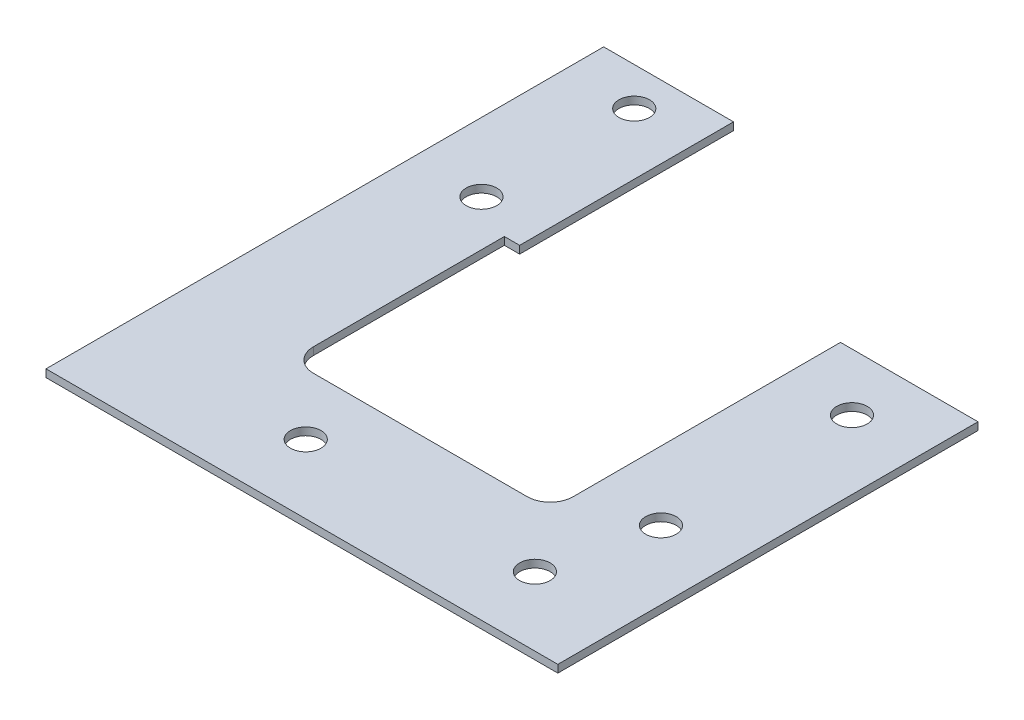
ISO-10303-21;
HEADER;
FILE_DESCRIPTION(('STEP AP214'),'2;1');
FILE_NAME('part.step','',(''),(''),'','','');
FILE_SCHEMA(('AUTOMOTIVE_DESIGN { 1 0 10303 214 1 1 1 1 }'));
ENDSEC;
DATA;
#1=APPLICATION_CONTEXT('core data for automotive mechanical design processes');
#2=APPLICATION_PROTOCOL_DEFINITION('international standard','automotive_design',2000,#1);
#3=PRODUCT_CONTEXT('',#1,'mechanical');
#4=PRODUCT('Part','Part','',(#3));
#5=PRODUCT_RELATED_PRODUCT_CATEGORY('part','',(#4));
#6=PRODUCT_DEFINITION_FORMATION('','',#4);
#7=PRODUCT_DEFINITION_CONTEXT('part definition',#1,'design');
#8=PRODUCT_DEFINITION('design','',#6,#7);
#9=PRODUCT_DEFINITION_SHAPE('','',#8);
#10=(LENGTH_UNIT() NAMED_UNIT(*) SI_UNIT(.MILLI.,.METRE.));
#11=(NAMED_UNIT(*) PLANE_ANGLE_UNIT() SI_UNIT($,.RADIAN.));
#12=(NAMED_UNIT(*) SI_UNIT($,.STERADIAN.) SOLID_ANGLE_UNIT());
#13=UNCERTAINTY_MEASURE_WITH_UNIT(LENGTH_MEASURE(1.E-05),#10,'distance_accuracy_value','');
#14=(GEOMETRIC_REPRESENTATION_CONTEXT(3) GLOBAL_UNCERTAINTY_ASSIGNED_CONTEXT((#13)) GLOBAL_UNIT_ASSIGNED_CONTEXT((#10,
#11,#12)) REPRESENTATION_CONTEXT('',''));
#15=CARTESIAN_POINT('',(0.,0.,0.));
#16=DIRECTION('',(0.,0.,1.));
#17=DIRECTION('',(1.,0.,0.));
#18=AXIS2_PLACEMENT_3D('',#15,#16,#17);
#19=CARTESIAN_POINT('',(-6.,1.,-5.));
#20=DIRECTION('',(0.,-1.,0.));
#21=DIRECTION('',(0.,0.,-1.));
#22=AXIS2_PLACEMENT_3D('',#19,#20,#21);
#23=PLANE('',#22);
#24=DIRECTION('',(0.,0.,-1.));
#25=VECTOR('',#24,1.);
#26=CARTESIAN_POINT('',(15.,1.,0.));
#27=LINE('',#26,#25);
#28=CARTESIAN_POINT('',(15.,1.,15.));
#29=VERTEX_POINT('',#28);
#30=CARTESIAN_POINT('',(15.,1.,-40.));
#31=VERTEX_POINT('',#30);
#32=EDGE_CURVE('E50',#29,#31,#27,.T.);
#33=ORIENTED_EDGE('',*,*,#32,.T.);
#34=DIRECTION('',(-1.,0.,0.));
#35=VECTOR('',#34,1.);
#36=CARTESIAN_POINT('',(0.,1.,-40.));
#37=LINE('',#36,#35);
#38=CARTESIAN_POINT('',(-3.,1.,-40.));
#39=VERTEX_POINT('',#38);
#40=EDGE_CURVE('E106',#31,#39,#37,.T.);
#41=ORIENTED_EDGE('',*,*,#40,.T.);
#42=DIRECTION('',(0.,0.,1.));
#43=VECTOR('',#42,1.);
#44=CARTESIAN_POINT('',(-3.,1.,-40.));
#45=LINE('',#44,#43);
#46=CARTESIAN_POINT('',(-3.,1.,-5.00000000000002));
#47=VERTEX_POINT('',#46);
#48=EDGE_CURVE('E207',#39,#47,#45,.T.);
#49=ORIENTED_EDGE('',*,*,#48,.T.);
#50=CARTESIAN_POINT('',(-6.,1.,-5.));
#51=DIRECTION('',(0.,-1.,0.));
#52=DIRECTION('',(0.,0.,-1.));
#53=AXIS2_PLACEMENT_3D('',#50,#51,#52);
#54=CIRCLE('',#53,3.);
#55=CARTESIAN_POINT('',(-6.00000000000002,1.,-2.));
#56=VERTEX_POINT('',#55);
#57=EDGE_CURVE('E226',#47,#56,#54,.T.);
#58=ORIENTED_EDGE('',*,*,#57,.T.);
#59=DIRECTION('',(-1.,0.,0.));
#60=VECTOR('',#59,1.);
#61=CARTESIAN_POINT('',(-6.00000000000002,1.,-2.));
#62=LINE('',#61,#60);
#63=CARTESIAN_POINT('',(-34.,1.,-2.));
#64=VERTEX_POINT('',#63);
#65=EDGE_CURVE('E223',#56,#64,#62,.T.);
#66=ORIENTED_EDGE('',*,*,#65,.T.);
#67=CARTESIAN_POINT('',(-34.,1.,-5.));
#68=DIRECTION('',(0.,-1.,0.));
#69=DIRECTION('',(0.,0.,-1.));
#70=AXIS2_PLACEMENT_3D('',#67,#68,#69);
#71=CIRCLE('',#70,3.);
#72=CARTESIAN_POINT('',(-37.,1.,-5.00000000000002));
#73=VERTEX_POINT('',#72);
#74=EDGE_CURVE('E225',#64,#73,#71,.T.);
#75=ORIENTED_EDGE('',*,*,#74,.T.);
#76=DIRECTION('',(0.,0.,-1.));
#77=VECTOR('',#76,1.);
#78=CARTESIAN_POINT('',(-37.,1.,-30.));
#79=LINE('',#78,#77);
#80=CARTESIAN_POINT('',(-37.,1.,-30.));
#81=VERTEX_POINT('',#80);
#82=EDGE_CURVE('E228',#73,#81,#79,.T.);
#83=ORIENTED_EDGE('',*,*,#82,.T.);
#84=DIRECTION('',(1.,0.,0.));
#85=VECTOR('',#84,1.);
#86=CARTESIAN_POINT('',(-35.,1.,-30.));
#87=LINE('',#86,#85);
#88=CARTESIAN_POINT('',(-35.,1.,-30.));
#89=VERTEX_POINT('',#88);
#90=EDGE_CURVE('E234',#81,#89,#87,.T.);
#91=ORIENTED_EDGE('',*,*,#90,.T.);
#92=DIRECTION('',(0.,0.,-1.));
#93=VECTOR('',#92,1.);
#94=CARTESIAN_POINT('',(-35.,1.,-58.));
#95=LINE('',#94,#93);
#96=CARTESIAN_POINT('',(-35.,1.,-58.));
#97=VERTEX_POINT('',#96);
#98=EDGE_CURVE('E138',#89,#97,#95,.T.);
#99=ORIENTED_EDGE('',*,*,#98,.T.);
#100=DIRECTION('',(-1.,0.,0.));
#101=VECTOR('',#100,1.);
#102=CARTESIAN_POINT('',(-37.,1.,-58.));
#103=LINE('',#102,#101);
#104=CARTESIAN_POINT('',(-52.,1.,-58.));
#105=VERTEX_POINT('',#104);
#106=EDGE_CURVE('E132',#97,#105,#103,.T.);
#107=ORIENTED_EDGE('',*,*,#106,.T.);
#108=DIRECTION('',(0.,0.,1.));
#109=VECTOR('',#108,1.);
#110=CARTESIAN_POINT('',(-52.,1.,15.));
#111=LINE('',#110,#109);
#112=CARTESIAN_POINT('',(-52.,1.,15.));
#113=VERTEX_POINT('',#112);
#114=EDGE_CURVE('E136',#105,#113,#111,.T.);
#115=ORIENTED_EDGE('',*,*,#114,.T.);
#116=DIRECTION('',(1.,0.,0.));
#117=VECTOR('',#116,1.);
#118=CARTESIAN_POINT('',(15.,1.,15.));
#119=LINE('',#118,#117);
#120=EDGE_CURVE('E151',#113,#29,#119,.T.);
#121=ORIENTED_EDGE('',*,*,#120,.T.);
#122=EDGE_LOOP('',(#33,#41,#49,#58,#66,#75,#83,#91,#99,#107,#115,#121));
#123=FACE_BOUND('',#122,.T.);
#124=CARTESIAN_POINT('',(6.,1.,-32.5));
#125=DIRECTION('',(0.,1.,0.));
#126=DIRECTION('',(0.,0.,1.));
#127=AXIS2_PLACEMENT_3D('',#124,#125,#126);
#128=CIRCLE('',#127,2.);
#129=CARTESIAN_POINT('',(6.,1.,-30.5));
#130=VERTEX_POINT('',#129);
#131=EDGE_CURVE('E160',#130,#130,#128,.T.);
#132=ORIENTED_EDGE('',*,*,#131,.F.);
#133=EDGE_LOOP('',(#132));
#134=FACE_BOUND('',#133,.T.);
#135=CARTESIAN_POINT('',(6.,1.,-7.5));
#136=DIRECTION('',(0.,1.,0.));
#137=DIRECTION('',(0.,0.,1.));
#138=AXIS2_PLACEMENT_3D('',#135,#136,#137);
#139=CIRCLE('',#138,2.);
#140=CARTESIAN_POINT('',(6.,1.,-5.5));
#141=VERTEX_POINT('',#140);
#142=EDGE_CURVE('E462',#141,#141,#139,.T.);
#143=ORIENTED_EDGE('',*,*,#142,.F.);
#144=EDGE_LOOP('',(#143));
#145=FACE_BOUND('',#144,.T.);
#146=CARTESIAN_POINT('',(-43.,1.,-53.));
#147=DIRECTION('',(0.,1.,0.));
#148=DIRECTION('',(0.,0.,1.));
#149=AXIS2_PLACEMENT_3D('',#146,#147,#148);
#150=CIRCLE('',#149,2.);
#151=CARTESIAN_POINT('',(-43.,1.,-51.));
#152=VERTEX_POINT('',#151);
#153=EDGE_CURVE('E456',#152,#152,#150,.T.);
#154=ORIENTED_EDGE('',*,*,#153,.F.);
#155=EDGE_LOOP('',(#154));
#156=FACE_BOUND('',#155,.T.);
#157=CARTESIAN_POINT('',(-43.,1.,-33.));
#158=DIRECTION('',(0.,1.,0.));
#159=DIRECTION('',(0.,0.,1.));
#160=AXIS2_PLACEMENT_3D('',#157,#158,#159);
#161=CIRCLE('',#160,2.);
#162=CARTESIAN_POINT('',(-43.,1.,-31.));
#163=VERTEX_POINT('',#162);
#164=EDGE_CURVE('E450',#163,#163,#161,.T.);
#165=ORIENTED_EDGE('',*,*,#164,.F.);
#166=EDGE_LOOP('',(#165));
#167=FACE_BOUND('',#166,.T.);
#168=CARTESIAN_POINT('',(-27.,1.,6.00000000000001));
#169=DIRECTION('',(0.,1.,0.));
#170=DIRECTION('',(0.,0.,1.));
#171=AXIS2_PLACEMENT_3D('',#168,#169,#170);
#172=CIRCLE('',#171,2.);
#173=CARTESIAN_POINT('',(-27.,1.,8.00000000000001));
#174=VERTEX_POINT('',#173);
#175=EDGE_CURVE('E444',#174,#174,#172,.T.);
#176=ORIENTED_EDGE('',*,*,#175,.F.);
#177=EDGE_LOOP('',(#176));
#178=FACE_BOUND('',#177,.T.);
#179=CARTESIAN_POINT('',(3.00000000000001,1.,5.99999999999999));
#180=DIRECTION('',(0.,1.,0.));
#181=DIRECTION('',(0.,0.,1.));
#182=AXIS2_PLACEMENT_3D('',#179,#180,#181);
#183=CIRCLE('',#182,2.);
#184=CARTESIAN_POINT('',(3.00000000000001,1.,7.99999999999999));
#185=VERTEX_POINT('',#184);
#186=EDGE_CURVE('E435',#185,#185,#183,.T.);
#187=ORIENTED_EDGE('',*,*,#186,.F.);
#188=EDGE_LOOP('',(#187));
#189=FACE_BOUND('',#188,.T.);
#190=ADVANCED_FACE('F33',(#123,#134,#145,#156,#167,#178,#189),#23,.F.);
#191=CARTESIAN_POINT('',(-6.,0.,-5.));
#192=DIRECTION('',(0.,-1.,0.));
#193=DIRECTION('',(0.,0.,-1.));
#194=AXIS2_PLACEMENT_3D('',#191,#192,#193);
#195=PLANE('',#194);
#196=CARTESIAN_POINT('',(-27.,0.,6.00000000000001));
#197=DIRECTION('',(0.,1.,0.));
#198=DIRECTION('',(0.,0.,1.));
#199=AXIS2_PLACEMENT_3D('',#196,#197,#198);
#200=CIRCLE('',#199,2.);
#201=CARTESIAN_POINT('',(-27.,0.,8.00000000000001));
#202=VERTEX_POINT('',#201);
#203=EDGE_CURVE('E441',#202,#202,#200,.T.);
#204=ORIENTED_EDGE('',*,*,#203,.T.);
#205=EDGE_LOOP('',(#204));
#206=FACE_BOUND('',#205,.T.);
#207=CARTESIAN_POINT('',(-43.,0.,-53.));
#208=DIRECTION('',(0.,1.,0.));
#209=DIRECTION('',(0.,0.,1.));
#210=AXIS2_PLACEMENT_3D('',#207,#208,#209);
#211=CIRCLE('',#210,2.);
#212=CARTESIAN_POINT('',(-43.,0.,-51.));
#213=VERTEX_POINT('',#212);
#214=EDGE_CURVE('E453',#213,#213,#211,.T.);
#215=ORIENTED_EDGE('',*,*,#214,.T.);
#216=EDGE_LOOP('',(#215));
#217=FACE_BOUND('',#216,.T.);
#218=CARTESIAN_POINT('',(6.,0.,-32.5));
#219=DIRECTION('',(0.,1.,0.));
#220=DIRECTION('',(0.,0.,1.));
#221=AXIS2_PLACEMENT_3D('',#218,#219,#220);
#222=CIRCLE('',#221,2.);
#223=CARTESIAN_POINT('',(6.,0.,-30.5));
#224=VERTEX_POINT('',#223);
#225=EDGE_CURVE('E465',#224,#224,#222,.T.);
#226=ORIENTED_EDGE('',*,*,#225,.T.);
#227=EDGE_LOOP('',(#226));
#228=FACE_BOUND('',#227,.T.);
#229=DIRECTION('',(-1.,0.,0.));
#230=VECTOR('',#229,1.);
#231=CARTESIAN_POINT('',(0.,0.,-40.));
#232=LINE('',#231,#230);
#233=CARTESIAN_POINT('',(15.,0.,-40.));
#234=VERTEX_POINT('',#233);
#235=CARTESIAN_POINT('',(-3.,0.,-40.));
#236=VERTEX_POINT('',#235);
#237=EDGE_CURVE('E157',#234,#236,#232,.T.);
#238=ORIENTED_EDGE('',*,*,#237,.F.);
#239=DIRECTION('',(0.,0.,-1.));
#240=VECTOR('',#239,1.);
#241=CARTESIAN_POINT('',(15.,0.,0.));
#242=LINE('',#241,#240);
#243=CARTESIAN_POINT('',(15.,0.,15.));
#244=VERTEX_POINT('',#243);
#245=EDGE_CURVE('E178',#244,#234,#242,.T.);
#246=ORIENTED_EDGE('',*,*,#245,.F.);
#247=DIRECTION('',(1.,0.,0.));
#248=VECTOR('',#247,1.);
#249=CARTESIAN_POINT('',(15.,0.,15.));
#250=LINE('',#249,#248);
#251=CARTESIAN_POINT('',(-52.,0.,15.));
#252=VERTEX_POINT('',#251);
#253=EDGE_CURVE('E99',#252,#244,#250,.T.);
#254=ORIENTED_EDGE('',*,*,#253,.F.);
#255=DIRECTION('',(0.,0.,1.));
#256=VECTOR('',#255,1.);
#257=CARTESIAN_POINT('',(-52.,0.,15.));
#258=LINE('',#257,#256);
#259=CARTESIAN_POINT('',(-52.,0.,-58.));
#260=VERTEX_POINT('',#259);
#261=EDGE_CURVE('E92',#260,#252,#258,.T.);
#262=ORIENTED_EDGE('',*,*,#261,.F.);
#263=DIRECTION('',(-1.,0.,0.));
#264=VECTOR('',#263,1.);
#265=CARTESIAN_POINT('',(-52.,0.,-58.));
#266=LINE('',#265,#264);
#267=CARTESIAN_POINT('',(-35.,0.,-58.));
#268=VERTEX_POINT('',#267);
#269=EDGE_CURVE('E145',#268,#260,#266,.T.);
#270=ORIENTED_EDGE('',*,*,#269,.F.);
#271=DIRECTION('',(0.,0.,-1.));
#272=VECTOR('',#271,1.);
#273=CARTESIAN_POINT('',(-35.,0.,-58.));
#274=LINE('',#273,#272);
#275=CARTESIAN_POINT('',(-35.,0.,-30.));
#276=VERTEX_POINT('',#275);
#277=EDGE_CURVE('E172',#276,#268,#274,.T.);
#278=ORIENTED_EDGE('',*,*,#277,.F.);
#279=DIRECTION('',(1.,0.,0.));
#280=VECTOR('',#279,1.);
#281=CARTESIAN_POINT('',(-35.,0.,-30.));
#282=LINE('',#281,#280);
#283=CARTESIAN_POINT('',(-37.,0.,-30.));
#284=VERTEX_POINT('',#283);
#285=EDGE_CURVE('E170',#284,#276,#282,.T.);
#286=ORIENTED_EDGE('',*,*,#285,.F.);
#287=DIRECTION('',(0.,0.,-1.));
#288=VECTOR('',#287,1.);
#289=CARTESIAN_POINT('',(-37.,0.,-30.));
#290=LINE('',#289,#288);
#291=CARTESIAN_POINT('',(-37.,0.,-5.00000000000002));
#292=VERTEX_POINT('',#291);
#293=EDGE_CURVE('E168',#292,#284,#290,.T.);
#294=ORIENTED_EDGE('',*,*,#293,.F.);
#295=CARTESIAN_POINT('',(-34.,0.,-5.));
#296=DIRECTION('',(0.,-1.,0.));
#297=DIRECTION('',(0.,0.,-1.));
#298=AXIS2_PLACEMENT_3D('',#295,#296,#297);
#299=CIRCLE('',#298,3.);
#300=CARTESIAN_POINT('',(-34.,0.,-2.));
#301=VERTEX_POINT('',#300);
#302=EDGE_CURVE('E166',#301,#292,#299,.T.);
#303=ORIENTED_EDGE('',*,*,#302,.F.);
#304=DIRECTION('',(-1.,0.,0.));
#305=VECTOR('',#304,1.);
#306=CARTESIAN_POINT('',(-6.00000000000002,0.,-2.));
#307=LINE('',#306,#305);
#308=CARTESIAN_POINT('',(-6.00000000000002,0.,-2.));
#309=VERTEX_POINT('',#308);
#310=EDGE_CURVE('E164',#309,#301,#307,.T.);
#311=ORIENTED_EDGE('',*,*,#310,.F.);
#312=CARTESIAN_POINT('',(-6.,0.,-5.));
#313=DIRECTION('',(0.,-1.,0.));
#314=DIRECTION('',(0.,0.,-1.));
#315=AXIS2_PLACEMENT_3D('',#312,#313,#314);
#316=CIRCLE('',#315,3.);
#317=CARTESIAN_POINT('',(-3.,0.,-5.00000000000002));
#318=VERTEX_POINT('',#317);
#319=EDGE_CURVE('E162',#318,#309,#316,.T.);
#320=ORIENTED_EDGE('',*,*,#319,.F.);
#321=DIRECTION('',(0.,0.,1.));
#322=VECTOR('',#321,1.);
#323=CARTESIAN_POINT('',(-3.,0.,-40.));
#324=LINE('',#323,#322);
#325=EDGE_CURVE('E159',#236,#318,#324,.T.);
#326=ORIENTED_EDGE('',*,*,#325,.F.);
#327=EDGE_LOOP('',(#238,#246,#254,#262,#270,#278,#286,#294,#303,#311,#320,#326));
#328=FACE_BOUND('',#327,.T.);
#329=CARTESIAN_POINT('',(6.,0.,-7.5));
#330=DIRECTION('',(0.,1.,0.));
#331=DIRECTION('',(0.,0.,1.));
#332=AXIS2_PLACEMENT_3D('',#329,#330,#331);
#333=CIRCLE('',#332,2.);
#334=CARTESIAN_POINT('',(6.,0.,-5.5));
#335=VERTEX_POINT('',#334);
#336=EDGE_CURVE('E459',#335,#335,#333,.T.);
#337=ORIENTED_EDGE('',*,*,#336,.T.);
#338=EDGE_LOOP('',(#337));
#339=FACE_BOUND('',#338,.T.);
#340=CARTESIAN_POINT('',(-43.,0.,-33.));
#341=DIRECTION('',(0.,1.,0.));
#342=DIRECTION('',(0.,0.,1.));
#343=AXIS2_PLACEMENT_3D('',#340,#341,#342);
#344=CIRCLE('',#343,2.);
#345=CARTESIAN_POINT('',(-43.,0.,-31.));
#346=VERTEX_POINT('',#345);
#347=EDGE_CURVE('E447',#346,#346,#344,.T.);
#348=ORIENTED_EDGE('',*,*,#347,.T.);
#349=EDGE_LOOP('',(#348));
#350=FACE_BOUND('',#349,.T.);
#351=CARTESIAN_POINT('',(3.00000000000001,0.,5.99999999999999));
#352=DIRECTION('',(0.,1.,0.));
#353=DIRECTION('',(0.,0.,1.));
#354=AXIS2_PLACEMENT_3D('',#351,#352,#353);
#355=CIRCLE('',#354,2.);
#356=CARTESIAN_POINT('',(3.00000000000001,0.,7.99999999999999));
#357=VERTEX_POINT('',#356);
#358=EDGE_CURVE('E438',#357,#357,#355,.T.);
#359=ORIENTED_EDGE('',*,*,#358,.T.);
#360=EDGE_LOOP('',(#359));
#361=FACE_BOUND('',#360,.T.);
#362=ADVANCED_FACE('F210',(#206,#217,#228,#328,#339,#350,#361),#195,.T.);
#363=CARTESIAN_POINT('',(0.,1.,-40.));
#364=DIRECTION('',(0.,0.,1.));
#365=DIRECTION('',(1.,0.,0.));
#366=AXIS2_PLACEMENT_3D('',#363,#364,#365);
#367=PLANE('',#366);
#368=ORIENTED_EDGE('',*,*,#237,.T.);
#369=DIRECTION('',(0.,-1.,0.));
#370=VECTOR('',#369,1.);
#371=CARTESIAN_POINT('',(-3.,1.,-40.));
#372=LINE('',#371,#370);
#373=EDGE_CURVE('E42',#39,#236,#372,.T.);
#374=ORIENTED_EDGE('',*,*,#373,.F.);
#375=ORIENTED_EDGE('',*,*,#40,.F.);
#376=DIRECTION('',(0.,-1.,0.));
#377=VECTOR('',#376,1.);
#378=CARTESIAN_POINT('',(15.,1.,-40.));
#379=LINE('',#378,#377);
#380=EDGE_CURVE('E11',#31,#234,#379,.T.);
#381=ORIENTED_EDGE('',*,*,#380,.T.);
#382=EDGE_LOOP('',(#368,#374,#375,#381));
#383=FACE_BOUND('',#382,.T.);
#384=ADVANCED_FACE('F35',(#383),#367,.F.);
#385=CARTESIAN_POINT('',(-3.,1.,-40.));
#386=DIRECTION('',(1.,0.,0.));
#387=DIRECTION('',(0.,0.,-1.));
#388=AXIS2_PLACEMENT_3D('',#385,#386,#387);
#389=PLANE('',#388);
#390=ORIENTED_EDGE('',*,*,#325,.T.);
#391=DIRECTION('',(0.,-1.,0.));
#392=VECTOR('',#391,1.);
#393=CARTESIAN_POINT('',(-3.,1.,-5.00000000000002));
#394=LINE('',#393,#392);
#395=EDGE_CURVE('E199',#47,#318,#394,.T.);
#396=ORIENTED_EDGE('',*,*,#395,.F.);
#397=ORIENTED_EDGE('',*,*,#48,.F.);
#398=ORIENTED_EDGE('',*,*,#373,.T.);
#399=EDGE_LOOP('',(#390,#396,#397,#398));
#400=FACE_BOUND('',#399,.T.);
#401=ADVANCED_FACE('F205',(#400),#389,.F.);
#402=CARTESIAN_POINT('',(-6.,1.,-5.));
#403=DIRECTION('',(0.,-1.,0.));
#404=DIRECTION('',(0.,0.,-1.));
#405=AXIS2_PLACEMENT_3D('',#402,#403,#404);
#406=CYLINDRICAL_SURFACE('',#405,3.);
#407=ORIENTED_EDGE('',*,*,#319,.T.);
#408=DIRECTION('',(0.,-1.,0.));
#409=VECTOR('',#408,1.);
#410=CARTESIAN_POINT('',(-6.00000000000002,1.,-2.));
#411=LINE('',#410,#409);
#412=EDGE_CURVE('E196',#56,#309,#411,.T.);
#413=ORIENTED_EDGE('',*,*,#412,.F.);
#414=ORIENTED_EDGE('',*,*,#57,.F.);
#415=ORIENTED_EDGE('',*,*,#395,.T.);
#416=EDGE_LOOP('',(#407,#413,#414,#415));
#417=FACE_BOUND('',#416,.T.);
#418=ADVANCED_FACE('F217',(#417),#406,.F.);
#419=CARTESIAN_POINT('',(-6.00000000000002,1.,-2.));
#420=DIRECTION('',(0.,0.,1.));
#421=DIRECTION('',(1.,0.,0.));
#422=AXIS2_PLACEMENT_3D('',#419,#420,#421);
#423=PLANE('',#422);
#424=ORIENTED_EDGE('',*,*,#310,.T.);
#425=DIRECTION('',(0.,-1.,0.));
#426=VECTOR('',#425,1.);
#427=CARTESIAN_POINT('',(-34.,1.,-2.));
#428=LINE('',#427,#426);
#429=EDGE_CURVE('E193',#64,#301,#428,.T.);
#430=ORIENTED_EDGE('',*,*,#429,.F.);
#431=ORIENTED_EDGE('',*,*,#65,.F.);
#432=ORIENTED_EDGE('',*,*,#412,.T.);
#433=EDGE_LOOP('',(#424,#430,#431,#432));
#434=FACE_BOUND('',#433,.T.);
#435=ADVANCED_FACE('F221',(#434),#423,.F.);
#436=CARTESIAN_POINT('',(-34.,1.,-5.));
#437=DIRECTION('',(0.,-1.,0.));
#438=DIRECTION('',(0.,0.,-1.));
#439=AXIS2_PLACEMENT_3D('',#436,#437,#438);
#440=CYLINDRICAL_SURFACE('',#439,3.);
#441=ORIENTED_EDGE('',*,*,#302,.T.);
#442=DIRECTION('',(0.,-1.,0.));
#443=VECTOR('',#442,1.);
#444=CARTESIAN_POINT('',(-37.,1.,-5.00000000000002));
#445=LINE('',#444,#443);
#446=EDGE_CURVE('E190',#73,#292,#445,.T.);
#447=ORIENTED_EDGE('',*,*,#446,.F.);
#448=ORIENTED_EDGE('',*,*,#74,.F.);
#449=ORIENTED_EDGE('',*,*,#429,.T.);
#450=EDGE_LOOP('',(#441,#447,#448,#449));
#451=FACE_BOUND('',#450,.T.);
#452=ADVANCED_FACE('F278',(#451),#440,.F.);
#453=CARTESIAN_POINT('',(-37.,1.,-30.));
#454=DIRECTION('',(-1.,0.,0.));
#455=DIRECTION('',(0.,0.,1.));
#456=AXIS2_PLACEMENT_3D('',#453,#454,#455);
#457=PLANE('',#456);
#458=ORIENTED_EDGE('',*,*,#293,.T.);
#459=DIRECTION('',(0.,-1.,0.));
#460=VECTOR('',#459,1.);
#461=CARTESIAN_POINT('',(-37.,1.,-30.));
#462=LINE('',#461,#460);
#463=EDGE_CURVE('E187',#81,#284,#462,.T.);
#464=ORIENTED_EDGE('',*,*,#463,.F.);
#465=ORIENTED_EDGE('',*,*,#82,.F.);
#466=ORIENTED_EDGE('',*,*,#446,.T.);
#467=EDGE_LOOP('',(#458,#464,#465,#466));
#468=FACE_BOUND('',#467,.T.);
#469=ADVANCED_FACE('F275',(#468),#457,.F.);
#470=CARTESIAN_POINT('',(-35.,1.,-30.));
#471=DIRECTION('',(0.,0.,-1.));
#472=DIRECTION('',(-1.,0.,0.));
#473=AXIS2_PLACEMENT_3D('',#470,#471,#472);
#474=PLANE('',#473);
#475=ORIENTED_EDGE('',*,*,#285,.T.);
#476=DIRECTION('',(0.,-1.,0.));
#477=VECTOR('',#476,1.);
#478=CARTESIAN_POINT('',(-35.,1.,-30.));
#479=LINE('',#478,#477);
#480=EDGE_CURVE('E184',#89,#276,#479,.T.);
#481=ORIENTED_EDGE('',*,*,#480,.F.);
#482=ORIENTED_EDGE('',*,*,#90,.F.);
#483=ORIENTED_EDGE('',*,*,#463,.T.);
#484=EDGE_LOOP('',(#475,#481,#482,#483));
#485=FACE_BOUND('',#484,.T.);
#486=ADVANCED_FACE('F240',(#485),#474,.F.);
#487=CARTESIAN_POINT('',(-35.,1.,-58.));
#488=DIRECTION('',(-1.,0.,0.));
#489=DIRECTION('',(0.,0.,1.));
#490=AXIS2_PLACEMENT_3D('',#487,#488,#489);
#491=PLANE('',#490);
#492=ORIENTED_EDGE('',*,*,#277,.T.);
#493=DIRECTION('',(0.,-1.,0.));
#494=VECTOR('',#493,1.);
#495=CARTESIAN_POINT('',(-35.,1.,-58.));
#496=LINE('',#495,#494);
#497=EDGE_CURVE('E146',#97,#268,#496,.T.);
#498=ORIENTED_EDGE('',*,*,#497,.F.);
#499=ORIENTED_EDGE('',*,*,#98,.F.);
#500=ORIENTED_EDGE('',*,*,#480,.T.);
#501=EDGE_LOOP('',(#492,#498,#499,#500));
#502=FACE_BOUND('',#501,.T.);
#503=ADVANCED_FACE('F244',(#502),#491,.F.);
#504=CARTESIAN_POINT('',(-52.,1.,-58.));
#505=DIRECTION('',(0.,0.,1.));
#506=DIRECTION('',(1.,0.,0.));
#507=AXIS2_PLACEMENT_3D('',#504,#505,#506);
#508=PLANE('',#507);
#509=ORIENTED_EDGE('',*,*,#269,.T.);
#510=DIRECTION('',(0.,-1.,0.));
#511=VECTOR('',#510,1.);
#512=CARTESIAN_POINT('',(-52.,1.,-58.));
#513=LINE('',#512,#511);
#514=EDGE_CURVE('E143',#105,#260,#513,.T.);
#515=ORIENTED_EDGE('',*,*,#514,.F.);
#516=ORIENTED_EDGE('',*,*,#106,.F.);
#517=ORIENTED_EDGE('',*,*,#497,.T.);
#518=EDGE_LOOP('',(#509,#515,#516,#517));
#519=FACE_BOUND('',#518,.T.);
#520=ADVANCED_FACE('F144',(#519),#508,.F.);
#521=CARTESIAN_POINT('',(-52.,1.,15.));
#522=DIRECTION('',(1.,0.,0.));
#523=DIRECTION('',(0.,0.,-1.));
#524=AXIS2_PLACEMENT_3D('',#521,#522,#523);
#525=PLANE('',#524);
#526=ORIENTED_EDGE('',*,*,#261,.T.);
#527=DIRECTION('',(0.,-1.,0.));
#528=VECTOR('',#527,1.);
#529=CARTESIAN_POINT('',(-52.,1.,15.));
#530=LINE('',#529,#528);
#531=EDGE_CURVE('E147',#113,#252,#530,.T.);
#532=ORIENTED_EDGE('',*,*,#531,.F.);
#533=ORIENTED_EDGE('',*,*,#114,.F.);
#534=ORIENTED_EDGE('',*,*,#514,.T.);
#535=EDGE_LOOP('',(#526,#532,#533,#534));
#536=FACE_BOUND('',#535,.T.);
#537=ADVANCED_FACE('F149',(#536),#525,.F.);
#538=CARTESIAN_POINT('',(15.,1.,15.));
#539=DIRECTION('',(0.,0.,-1.));
#540=DIRECTION('',(-1.,0.,0.));
#541=AXIS2_PLACEMENT_3D('',#538,#539,#540);
#542=PLANE('',#541);
#543=ORIENTED_EDGE('',*,*,#253,.T.);
#544=DIRECTION('',(0.,-1.,0.));
#545=VECTOR('',#544,1.);
#546=CARTESIAN_POINT('',(15.,1.,15.));
#547=LINE('',#546,#545);
#548=EDGE_CURVE('E153',#29,#244,#547,.T.);
#549=ORIENTED_EDGE('',*,*,#548,.F.);
#550=ORIENTED_EDGE('',*,*,#120,.F.);
#551=ORIENTED_EDGE('',*,*,#531,.T.);
#552=EDGE_LOOP('',(#543,#549,#550,#551));
#553=FACE_BOUND('',#552,.T.);
#554=ADVANCED_FACE('F264',(#553),#542,.F.);
#555=CARTESIAN_POINT('',(15.,1.,0.));
#556=DIRECTION('',(-1.,0.,0.));
#557=DIRECTION('',(0.,0.,1.));
#558=AXIS2_PLACEMENT_3D('',#555,#556,#557);
#559=PLANE('',#558);
#560=ORIENTED_EDGE('',*,*,#245,.T.);
#561=ORIENTED_EDGE('',*,*,#380,.F.);
#562=ORIENTED_EDGE('',*,*,#32,.F.);
#563=ORIENTED_EDGE('',*,*,#548,.T.);
#564=EDGE_LOOP('',(#560,#561,#562,#563));
#565=FACE_BOUND('',#564,.T.);
#566=ADVANCED_FACE('F246',(#565),#559,.F.);
#567=CARTESIAN_POINT('',(6.,1.,-32.5));
#568=DIRECTION('',(0.,-1.,0.));
#569=DIRECTION('',(0.,0.,-1.));
#570=AXIS2_PLACEMENT_3D('',#567,#568,#569);
#571=CYLINDRICAL_SURFACE('',#570,2.);
#572=ORIENTED_EDGE('',*,*,#131,.T.);
#573=EDGE_LOOP('',(#572));
#574=FACE_BOUND('',#573,.T.);
#575=ORIENTED_EDGE('',*,*,#225,.F.);
#576=EDGE_LOOP('',(#575));
#577=FACE_BOUND('',#576,.T.);
#578=ADVANCED_FACE('F259',(#574,#577),#571,.F.);
#579=CARTESIAN_POINT('',(6.,1.,-7.5));
#580=DIRECTION('',(0.,-1.,0.));
#581=DIRECTION('',(0.,0.,-1.));
#582=AXIS2_PLACEMENT_3D('',#579,#580,#581);
#583=CYLINDRICAL_SURFACE('',#582,2.);
#584=ORIENTED_EDGE('',*,*,#142,.T.);
#585=EDGE_LOOP('',(#584));
#586=FACE_BOUND('',#585,.T.);
#587=ORIENTED_EDGE('',*,*,#336,.F.);
#588=EDGE_LOOP('',(#587));
#589=FACE_BOUND('',#588,.T.);
#590=ADVANCED_FACE('F332',(#586,#589),#583,.F.);
#591=CARTESIAN_POINT('',(-43.,1.,-53.));
#592=DIRECTION('',(0.,-1.,0.));
#593=DIRECTION('',(0.,0.,-1.));
#594=AXIS2_PLACEMENT_3D('',#591,#592,#593);
#595=CYLINDRICAL_SURFACE('',#594,2.);
#596=ORIENTED_EDGE('',*,*,#153,.T.);
#597=EDGE_LOOP('',(#596));
#598=FACE_BOUND('',#597,.T.);
#599=ORIENTED_EDGE('',*,*,#214,.F.);
#600=EDGE_LOOP('',(#599));
#601=FACE_BOUND('',#600,.T.);
#602=ADVANCED_FACE('F339',(#598,#601),#595,.F.);
#603=CARTESIAN_POINT('',(-43.,1.,-33.));
#604=DIRECTION('',(0.,-1.,0.));
#605=DIRECTION('',(0.,0.,-1.));
#606=AXIS2_PLACEMENT_3D('',#603,#604,#605);
#607=CYLINDRICAL_SURFACE('',#606,2.);
#608=ORIENTED_EDGE('',*,*,#164,.T.);
#609=EDGE_LOOP('',(#608));
#610=FACE_BOUND('',#609,.T.);
#611=ORIENTED_EDGE('',*,*,#347,.F.);
#612=EDGE_LOOP('',(#611));
#613=FACE_BOUND('',#612,.T.);
#614=ADVANCED_FACE('F346',(#610,#613),#607,.F.);
#615=CARTESIAN_POINT('',(-27.,1.,6.00000000000001));
#616=DIRECTION('',(0.,-1.,0.));
#617=DIRECTION('',(0.,0.,-1.));
#618=AXIS2_PLACEMENT_3D('',#615,#616,#617);
#619=CYLINDRICAL_SURFACE('',#618,2.);
#620=ORIENTED_EDGE('',*,*,#175,.T.);
#621=EDGE_LOOP('',(#620));
#622=FACE_BOUND('',#621,.T.);
#623=ORIENTED_EDGE('',*,*,#203,.F.);
#624=EDGE_LOOP('',(#623));
#625=FACE_BOUND('',#624,.T.);
#626=ADVANCED_FACE('F354',(#622,#625),#619,.F.);
#627=CARTESIAN_POINT('',(3.00000000000001,1.,5.99999999999999));
#628=DIRECTION('',(0.,-1.,0.));
#629=DIRECTION('',(0.,0.,-1.));
#630=AXIS2_PLACEMENT_3D('',#627,#628,#629);
#631=CYLINDRICAL_SURFACE('',#630,2.);
#632=ORIENTED_EDGE('',*,*,#186,.T.);
#633=EDGE_LOOP('',(#632));
#634=FACE_BOUND('',#633,.T.);
#635=ORIENTED_EDGE('',*,*,#358,.F.);
#636=EDGE_LOOP('',(#635));
#637=FACE_BOUND('',#636,.T.);
#638=ADVANCED_FACE('F362',(#634,#637),#631,.F.);
#639=CLOSED_SHELL('',(#190,#362,#384,#401,#418,#435,#452,#469,#486,#503,#520,#537,#554,#566,
#578,#590,#602,#614,#626,#638));
#640=MANIFOLD_SOLID_BREP('B2',#639);
#641=ADVANCED_BREP_SHAPE_REPRESENTATION('',(#18,#640),#14);
#642=SHAPE_DEFINITION_REPRESENTATION(#9,#641);
ENDSEC;
END-ISO-10303-21;
